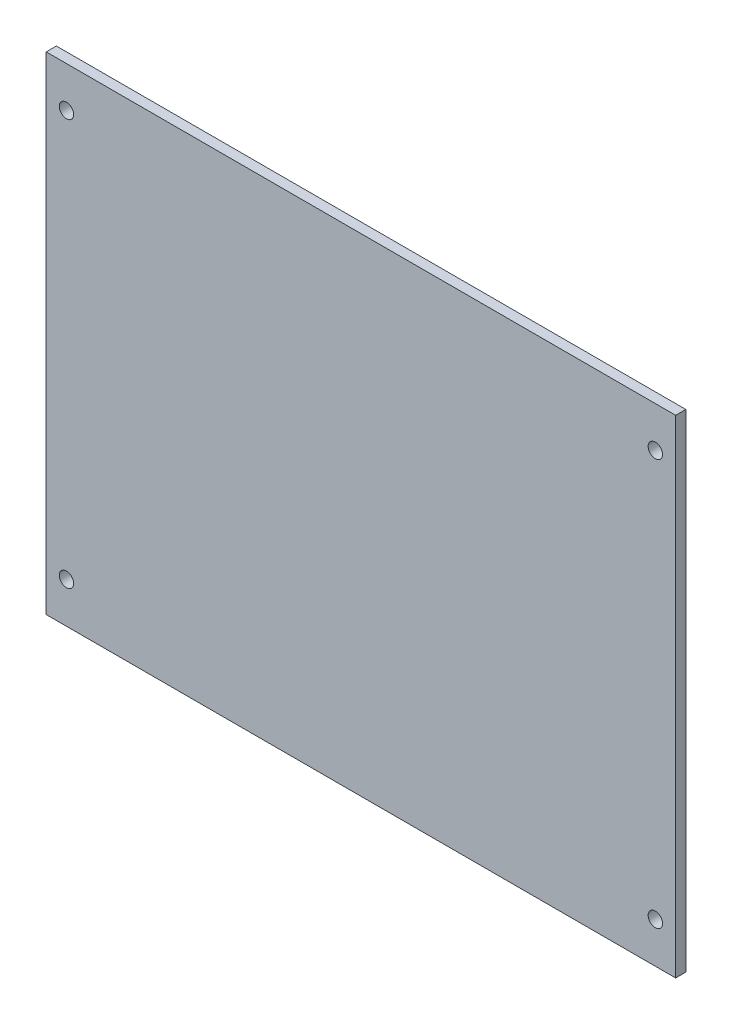
ISO-10303-21;
HEADER;
FILE_DESCRIPTION(('STEP AP214'),'2;1');
FILE_NAME('part.step','',(''),(''),'','','');
FILE_SCHEMA(('AUTOMOTIVE_DESIGN { 1 0 10303 214 1 1 1 1 }'));
ENDSEC;
DATA;
#1=APPLICATION_CONTEXT('core data for automotive mechanical design processes');
#2=APPLICATION_PROTOCOL_DEFINITION('international standard','automotive_design',2000,#1);
#3=PRODUCT_CONTEXT('',#1,'mechanical');
#4=PRODUCT('Part','Part','',(#3));
#5=PRODUCT_RELATED_PRODUCT_CATEGORY('part','',(#4));
#6=PRODUCT_DEFINITION_FORMATION('','',#4);
#7=PRODUCT_DEFINITION_CONTEXT('part definition',#1,'design');
#8=PRODUCT_DEFINITION('design','',#6,#7);
#9=PRODUCT_DEFINITION_SHAPE('','',#8);
#10=(LENGTH_UNIT() NAMED_UNIT(*) SI_UNIT(.MILLI.,.METRE.));
#11=(NAMED_UNIT(*) PLANE_ANGLE_UNIT() SI_UNIT($,.RADIAN.));
#12=(NAMED_UNIT(*) SI_UNIT($,.STERADIAN.) SOLID_ANGLE_UNIT());
#13=UNCERTAINTY_MEASURE_WITH_UNIT(LENGTH_MEASURE(1.E-05),#10,'distance_accuracy_value','');
#14=(GEOMETRIC_REPRESENTATION_CONTEXT(3) GLOBAL_UNCERTAINTY_ASSIGNED_CONTEXT((#13)) GLOBAL_UNIT_ASSIGNED_CONTEXT((#10,
#11,#12)) REPRESENTATION_CONTEXT('',''));
#15=CARTESIAN_POINT('',(0.,0.,0.));
#16=DIRECTION('',(0.,0.,1.));
#17=DIRECTION('',(1.,0.,0.));
#18=AXIS2_PLACEMENT_3D('',#15,#16,#17);
#19=CARTESIAN_POINT('',(0.,0.,3.175));
#20=DIRECTION('',(0.,0.,1.));
#21=DIRECTION('',(1.,0.,0.));
#22=AXIS2_PLACEMENT_3D('',#19,#20,#21);
#23=PLANE('',#22);
#24=CARTESIAN_POINT('',(92.075,-63.5,3.175));
#25=DIRECTION('',(0.,0.,1.));
#26=DIRECTION('',(1.,0.,0.));
#27=AXIS2_PLACEMENT_3D('',#24,#25,#26);
#28=CIRCLE('',#27,2.25);
#29=CARTESIAN_POINT('',(94.325,-63.5,3.175));
#30=VERTEX_POINT('',#29);
#31=EDGE_CURVE('E127',#30,#30,#28,.T.);
#32=ORIENTED_EDGE('',*,*,#31,.F.);
#33=EDGE_LOOP('',(#32));
#34=FACE_BOUND('',#33,.T.);
#35=CARTESIAN_POINT('',(-92.075,63.5,3.175));
#36=DIRECTION('',(0.,0.,1.));
#37=DIRECTION('',(1.,0.,0.));
#38=AXIS2_PLACEMENT_3D('',#35,#36,#37);
#39=CIRCLE('',#38,2.25);
#40=CARTESIAN_POINT('',(-89.825,63.5,3.175));
#41=VERTEX_POINT('',#40);
#42=EDGE_CURVE('E106',#41,#41,#39,.T.);
#43=ORIENTED_EDGE('',*,*,#42,.F.);
#44=EDGE_LOOP('',(#43));
#45=FACE_BOUND('',#44,.T.);
#46=DIRECTION('',(0.,-1.,0.));
#47=VECTOR('',#46,1.);
#48=CARTESIAN_POINT('',(-98.425,-76.2,3.175));
#49=LINE('',#48,#47);
#50=CARTESIAN_POINT('',(-98.425,76.2,3.175));
#51=VERTEX_POINT('',#50);
#52=CARTESIAN_POINT('',(-98.425,-76.2,3.175));
#53=VERTEX_POINT('',#52);
#54=EDGE_CURVE('E91',#51,#53,#49,.T.);
#55=ORIENTED_EDGE('',*,*,#54,.T.);
#56=DIRECTION('',(1.,0.,0.));
#57=VECTOR('',#56,1.);
#58=CARTESIAN_POINT('',(98.425,-76.2,3.175));
#59=LINE('',#58,#57);
#60=CARTESIAN_POINT('',(98.425,-76.2,3.175));
#61=VERTEX_POINT('',#60);
#62=EDGE_CURVE('E86',#53,#61,#59,.T.);
#63=ORIENTED_EDGE('',*,*,#62,.T.);
#64=DIRECTION('',(0.,1.,0.));
#65=VECTOR('',#64,1.);
#66=CARTESIAN_POINT('',(98.425,-76.2,3.175));
#67=LINE('',#66,#65);
#68=CARTESIAN_POINT('',(98.425,76.2,3.175));
#69=VERTEX_POINT('',#68);
#70=EDGE_CURVE('E89',#61,#69,#67,.T.);
#71=ORIENTED_EDGE('',*,*,#70,.T.);
#72=DIRECTION('',(-1.,0.,0.));
#73=VECTOR('',#72,1.);
#74=CARTESIAN_POINT('',(98.425,76.2,3.175));
#75=LINE('',#74,#73);
#76=EDGE_CURVE('E56',#69,#51,#75,.T.);
#77=ORIENTED_EDGE('',*,*,#76,.T.);
#78=EDGE_LOOP('',(#55,#63,#71,#77));
#79=FACE_BOUND('',#78,.T.);
#80=CARTESIAN_POINT('',(92.0749999999986,63.5,3.175));
#81=DIRECTION('',(0.,0.,1.));
#82=DIRECTION('',(1.,0.,0.));
#83=AXIS2_PLACEMENT_3D('',#80,#81,#82);
#84=CIRCLE('',#83,2.25);
#85=CARTESIAN_POINT('',(94.3249999999987,63.5,3.175));
#86=VERTEX_POINT('',#85);
#87=EDGE_CURVE('E121',#86,#86,#84,.T.);
#88=ORIENTED_EDGE('',*,*,#87,.F.);
#89=EDGE_LOOP('',(#88));
#90=FACE_BOUND('',#89,.T.);
#91=CARTESIAN_POINT('',(-92.0749999999987,-63.4999999999999,3.175));
#92=DIRECTION('',(0.,0.,1.));
#93=DIRECTION('',(1.,0.,0.));
#94=AXIS2_PLACEMENT_3D('',#91,#92,#93);
#95=CIRCLE('',#94,2.25);
#96=CARTESIAN_POINT('',(-89.8249999999987,-63.4999999999999,3.175));
#97=VERTEX_POINT('',#96);
#98=EDGE_CURVE('E133',#97,#97,#95,.T.);
#99=ORIENTED_EDGE('',*,*,#98,.F.);
#100=EDGE_LOOP('',(#99));
#101=FACE_BOUND('',#100,.T.);
#102=ADVANCED_FACE('F39',(#34,#45,#79,#90,#101),#23,.T.);
#103=CARTESIAN_POINT('',(0.,0.,0.));
#104=DIRECTION('',(0.,0.,1.));
#105=DIRECTION('',(1.,0.,0.));
#106=AXIS2_PLACEMENT_3D('',#103,#104,#105);
#107=PLANE('',#106);
#108=DIRECTION('',(0.,-1.,0.));
#109=VECTOR('',#108,1.);
#110=CARTESIAN_POINT('',(-98.425,-76.2,0.));
#111=LINE('',#110,#109);
#112=CARTESIAN_POINT('',(-98.425,76.2,0.));
#113=VERTEX_POINT('',#112);
#114=CARTESIAN_POINT('',(-98.425,-76.2,0.));
#115=VERTEX_POINT('',#114);
#116=EDGE_CURVE('E103',#113,#115,#111,.T.);
#117=ORIENTED_EDGE('',*,*,#116,.F.);
#118=DIRECTION('',(-1.,0.,0.));
#119=VECTOR('',#118,1.);
#120=CARTESIAN_POINT('',(98.425,76.2,0.));
#121=LINE('',#120,#119);
#122=CARTESIAN_POINT('',(98.425,76.2,0.));
#123=VERTEX_POINT('',#122);
#124=EDGE_CURVE('E79',#123,#113,#121,.T.);
#125=ORIENTED_EDGE('',*,*,#124,.F.);
#126=DIRECTION('',(0.,1.,0.));
#127=VECTOR('',#126,1.);
#128=CARTESIAN_POINT('',(98.425,-76.2,0.));
#129=LINE('',#128,#127);
#130=CARTESIAN_POINT('',(98.425,-76.2,0.));
#131=VERTEX_POINT('',#130);
#132=EDGE_CURVE('E73',#131,#123,#129,.T.);
#133=ORIENTED_EDGE('',*,*,#132,.F.);
#134=DIRECTION('',(1.,0.,0.));
#135=VECTOR('',#134,1.);
#136=CARTESIAN_POINT('',(98.425,-76.2,0.));
#137=LINE('',#136,#135);
#138=EDGE_CURVE('E95',#115,#131,#137,.T.);
#139=ORIENTED_EDGE('',*,*,#138,.F.);
#140=EDGE_LOOP('',(#117,#125,#133,#139));
#141=FACE_BOUND('',#140,.T.);
#142=CARTESIAN_POINT('',(-92.075,63.5,0.));
#143=DIRECTION('',(0.,0.,1.));
#144=DIRECTION('',(1.,0.,0.));
#145=AXIS2_PLACEMENT_3D('',#142,#143,#144);
#146=CIRCLE('',#145,2.25);
#147=CARTESIAN_POINT('',(-89.825,63.5,0.));
#148=VERTEX_POINT('',#147);
#149=EDGE_CURVE('E118',#148,#148,#146,.T.);
#150=ORIENTED_EDGE('',*,*,#149,.T.);
#151=EDGE_LOOP('',(#150));
#152=FACE_BOUND('',#151,.T.);
#153=CARTESIAN_POINT('',(92.0749999999986,63.5,0.));
#154=DIRECTION('',(0.,0.,1.));
#155=DIRECTION('',(1.,0.,0.));
#156=AXIS2_PLACEMENT_3D('',#153,#154,#155);
#157=CIRCLE('',#156,2.25);
#158=CARTESIAN_POINT('',(94.3249999999987,63.5,0.));
#159=VERTEX_POINT('',#158);
#160=EDGE_CURVE('E124',#159,#159,#157,.T.);
#161=ORIENTED_EDGE('',*,*,#160,.T.);
#162=EDGE_LOOP('',(#161));
#163=FACE_BOUND('',#162,.T.);
#164=CARTESIAN_POINT('',(92.075,-63.5,0.));
#165=DIRECTION('',(0.,0.,1.));
#166=DIRECTION('',(1.,0.,0.));
#167=AXIS2_PLACEMENT_3D('',#164,#165,#166);
#168=CIRCLE('',#167,2.25);
#169=CARTESIAN_POINT('',(94.325,-63.5,0.));
#170=VERTEX_POINT('',#169);
#171=EDGE_CURVE('E130',#170,#170,#168,.T.);
#172=ORIENTED_EDGE('',*,*,#171,.T.);
#173=EDGE_LOOP('',(#172));
#174=FACE_BOUND('',#173,.T.);
#175=CARTESIAN_POINT('',(-92.0749999999987,-63.4999999999999,0.));
#176=DIRECTION('',(0.,0.,1.));
#177=DIRECTION('',(1.,0.,0.));
#178=AXIS2_PLACEMENT_3D('',#175,#176,#177);
#179=CIRCLE('',#178,2.25);
#180=CARTESIAN_POINT('',(-89.8249999999987,-63.4999999999999,0.));
#181=VERTEX_POINT('',#180);
#182=EDGE_CURVE('E136',#181,#181,#179,.T.);
#183=ORIENTED_EDGE('',*,*,#182,.T.);
#184=EDGE_LOOP('',(#183));
#185=FACE_BOUND('',#184,.T.);
#186=ADVANCED_FACE('F114',(#141,#152,#163,#174,#185),#107,.F.);
#187=CARTESIAN_POINT('',(-98.425,-76.2,3.175));
#188=DIRECTION('',(1.,0.,0.));
#189=DIRECTION('',(0.,0.,-1.));
#190=AXIS2_PLACEMENT_3D('',#187,#188,#189);
#191=PLANE('',#190);
#192=ORIENTED_EDGE('',*,*,#116,.T.);
#193=DIRECTION('',(0.,0.,-1.));
#194=VECTOR('',#193,1.);
#195=CARTESIAN_POINT('',(-98.425,-76.2,3.175));
#196=LINE('',#195,#194);
#197=EDGE_CURVE('E11',#53,#115,#196,.T.);
#198=ORIENTED_EDGE('',*,*,#197,.F.);
#199=ORIENTED_EDGE('',*,*,#54,.F.);
#200=DIRECTION('',(0.,0.,-1.));
#201=VECTOR('',#200,1.);
#202=CARTESIAN_POINT('',(-98.425,76.2,3.175));
#203=LINE('',#202,#201);
#204=EDGE_CURVE('E99',#51,#113,#203,.T.);
#205=ORIENTED_EDGE('',*,*,#204,.T.);
#206=EDGE_LOOP('',(#192,#198,#199,#205));
#207=FACE_BOUND('',#206,.T.);
#208=ADVANCED_FACE('F41',(#207),#191,.F.);
#209=CARTESIAN_POINT('',(98.425,-76.2,3.175));
#210=DIRECTION('',(0.,1.,0.));
#211=DIRECTION('',(-1.,0.,0.));
#212=AXIS2_PLACEMENT_3D('',#209,#210,#211);
#213=PLANE('',#212);
#214=ORIENTED_EDGE('',*,*,#138,.T.);
#215=DIRECTION('',(0.,0.,-1.));
#216=VECTOR('',#215,1.);
#217=CARTESIAN_POINT('',(98.425,-76.2,3.175));
#218=LINE('',#217,#216);
#219=EDGE_CURVE('E48',#61,#131,#218,.T.);
#220=ORIENTED_EDGE('',*,*,#219,.F.);
#221=ORIENTED_EDGE('',*,*,#62,.F.);
#222=ORIENTED_EDGE('',*,*,#197,.T.);
#223=EDGE_LOOP('',(#214,#220,#221,#222));
#224=FACE_BOUND('',#223,.T.);
#225=ADVANCED_FACE('F94',(#224),#213,.F.);
#226=CARTESIAN_POINT('',(98.425,-76.2,3.175));
#227=DIRECTION('',(-1.,0.,0.));
#228=DIRECTION('',(0.,0.,1.));
#229=AXIS2_PLACEMENT_3D('',#226,#227,#228);
#230=PLANE('',#229);
#231=ORIENTED_EDGE('',*,*,#132,.T.);
#232=DIRECTION('',(0.,0.,-1.));
#233=VECTOR('',#232,1.);
#234=CARTESIAN_POINT('',(98.425,76.2,3.175));
#235=LINE('',#234,#233);
#236=EDGE_CURVE('E96',#69,#123,#235,.T.);
#237=ORIENTED_EDGE('',*,*,#236,.F.);
#238=ORIENTED_EDGE('',*,*,#70,.F.);
#239=ORIENTED_EDGE('',*,*,#219,.T.);
#240=EDGE_LOOP('',(#231,#237,#238,#239));
#241=FACE_BOUND('',#240,.T.);
#242=ADVANCED_FACE('F97',(#241),#230,.F.);
#243=CARTESIAN_POINT('',(98.425,76.2,3.175));
#244=DIRECTION('',(0.,-1.,0.));
#245=DIRECTION('',(1.,0.,0.));
#246=AXIS2_PLACEMENT_3D('',#243,#244,#245);
#247=PLANE('',#246);
#248=ORIENTED_EDGE('',*,*,#124,.T.);
#249=ORIENTED_EDGE('',*,*,#204,.F.);
#250=ORIENTED_EDGE('',*,*,#76,.F.);
#251=ORIENTED_EDGE('',*,*,#236,.T.);
#252=EDGE_LOOP('',(#248,#249,#250,#251));
#253=FACE_BOUND('',#252,.T.);
#254=ADVANCED_FACE('F111',(#253),#247,.F.);
#255=CARTESIAN_POINT('',(-92.075,63.5,3.175));
#256=DIRECTION('',(0.,0.,-1.));
#257=DIRECTION('',(-1.,0.,0.));
#258=AXIS2_PLACEMENT_3D('',#255,#256,#257);
#259=CYLINDRICAL_SURFACE('',#258,2.25);
#260=ORIENTED_EDGE('',*,*,#42,.T.);
#261=EDGE_LOOP('',(#260));
#262=FACE_BOUND('',#261,.T.);
#263=ORIENTED_EDGE('',*,*,#149,.F.);
#264=EDGE_LOOP('',(#263));
#265=FACE_BOUND('',#264,.T.);
#266=ADVANCED_FACE('F155',(#262,#265),#259,.F.);
#267=CARTESIAN_POINT('',(92.0749999999986,63.5,3.175));
#268=DIRECTION('',(0.,0.,-1.));
#269=DIRECTION('',(-1.,0.,0.));
#270=AXIS2_PLACEMENT_3D('',#267,#268,#269);
#271=CYLINDRICAL_SURFACE('',#270,2.25);
#272=ORIENTED_EDGE('',*,*,#87,.T.);
#273=EDGE_LOOP('',(#272));
#274=FACE_BOUND('',#273,.T.);
#275=ORIENTED_EDGE('',*,*,#160,.F.);
#276=EDGE_LOOP('',(#275));
#277=FACE_BOUND('',#276,.T.);
#278=ADVANCED_FACE('F200',(#274,#277),#271,.F.);
#279=CARTESIAN_POINT('',(92.075,-63.5,3.175));
#280=DIRECTION('',(0.,0.,-1.));
#281=DIRECTION('',(-1.,0.,0.));
#282=AXIS2_PLACEMENT_3D('',#279,#280,#281);
#283=CYLINDRICAL_SURFACE('',#282,2.25);
#284=ORIENTED_EDGE('',*,*,#31,.T.);
#285=EDGE_LOOP('',(#284));
#286=FACE_BOUND('',#285,.T.);
#287=ORIENTED_EDGE('',*,*,#171,.F.);
#288=EDGE_LOOP('',(#287));
#289=FACE_BOUND('',#288,.T.);
#290=ADVANCED_FACE('F208',(#286,#289),#283,.F.);
#291=CARTESIAN_POINT('',(-92.0749999999987,-63.4999999999999,3.175));
#292=DIRECTION('',(0.,0.,-1.));
#293=DIRECTION('',(-1.,0.,0.));
#294=AXIS2_PLACEMENT_3D('',#291,#292,#293);
#295=CYLINDRICAL_SURFACE('',#294,2.25);
#296=ORIENTED_EDGE('',*,*,#98,.T.);
#297=EDGE_LOOP('',(#296));
#298=FACE_BOUND('',#297,.T.);
#299=ORIENTED_EDGE('',*,*,#182,.F.);
#300=EDGE_LOOP('',(#299));
#301=FACE_BOUND('',#300,.T.);
#302=ADVANCED_FACE('F142',(#298,#301),#295,.F.);
#303=CLOSED_SHELL('',(#102,#186,#208,#225,#242,#254,#266,#278,#290,#302));
#304=MANIFOLD_SOLID_BREP('B2',#303);
#305=ADVANCED_BREP_SHAPE_REPRESENTATION('',(#18,#304),#14);
#306=SHAPE_DEFINITION_REPRESENTATION(#9,#305);
ENDSEC;
END-ISO-10303-21;
